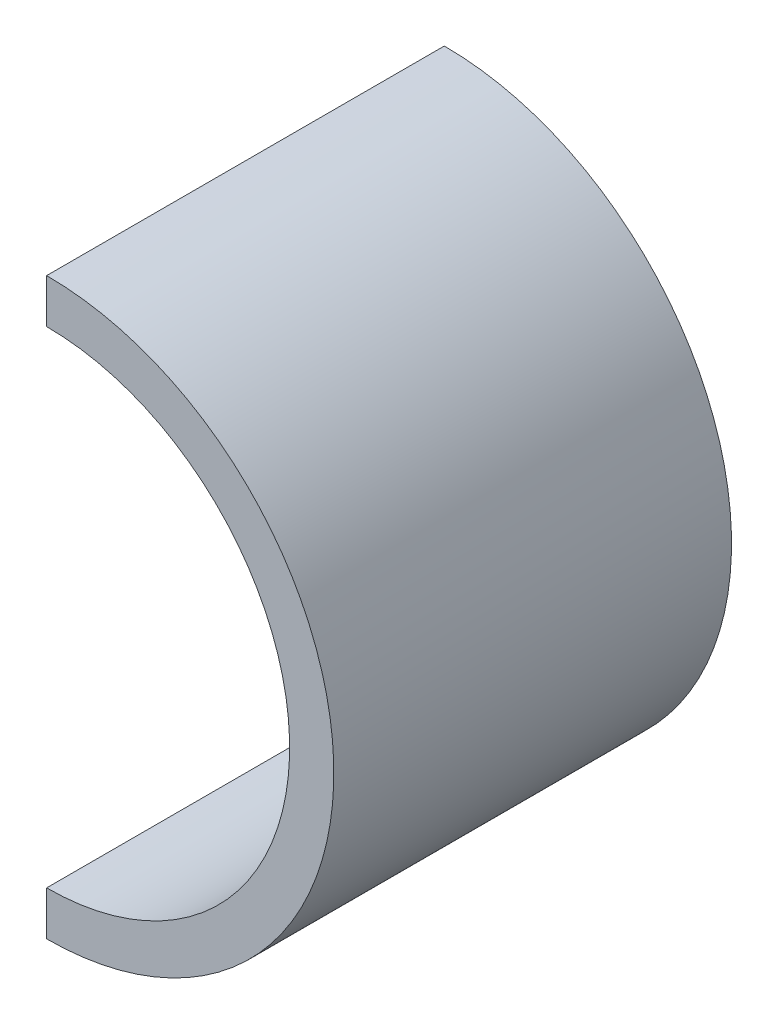
ISO-10303-21;
HEADER;
FILE_DESCRIPTION(('STEP AP214'),'2;1');
FILE_NAME('part.step','',(''),(''),'','','');
FILE_SCHEMA(('AUTOMOTIVE_DESIGN { 1 0 10303 214 1 1 1 1 }'));
ENDSEC;
DATA;
#1=APPLICATION_CONTEXT('core data for automotive mechanical design processes');
#2=APPLICATION_PROTOCOL_DEFINITION('international standard','automotive_design',2000,#1);
#3=PRODUCT_CONTEXT('',#1,'mechanical');
#4=PRODUCT('Part','Part','',(#3));
#5=PRODUCT_RELATED_PRODUCT_CATEGORY('part','',(#4));
#6=PRODUCT_DEFINITION_FORMATION('','',#4);
#7=PRODUCT_DEFINITION_CONTEXT('part definition',#1,'design');
#8=PRODUCT_DEFINITION('design','',#6,#7);
#9=PRODUCT_DEFINITION_SHAPE('','',#8);
#10=(LENGTH_UNIT() NAMED_UNIT(*) SI_UNIT(.MILLI.,.METRE.));
#11=(NAMED_UNIT(*) PLANE_ANGLE_UNIT() SI_UNIT($,.RADIAN.));
#12=(NAMED_UNIT(*) SI_UNIT($,.STERADIAN.) SOLID_ANGLE_UNIT());
#13=UNCERTAINTY_MEASURE_WITH_UNIT(LENGTH_MEASURE(1.E-05),#10,'distance_accuracy_value','');
#14=(GEOMETRIC_REPRESENTATION_CONTEXT(3) GLOBAL_UNCERTAINTY_ASSIGNED_CONTEXT((#13)) GLOBAL_UNIT_ASSIGNED_CONTEXT((#10,
#11,#12)) REPRESENTATION_CONTEXT('',''));
#15=CARTESIAN_POINT('',(0.,0.,0.));
#16=DIRECTION('',(0.,0.,1.));
#17=DIRECTION('',(1.,0.,0.));
#18=AXIS2_PLACEMENT_3D('',#15,#16,#17);
#19=CARTESIAN_POINT('',(0.,0.,180.));
#20=DIRECTION('',(0.,0.,-1.));
#21=DIRECTION('',(-1.,0.,0.));
#22=AXIS2_PLACEMENT_3D('',#19,#20,#21);
#23=CYLINDRICAL_SURFACE('',#22,130.);
#24=CARTESIAN_POINT('',(0.,0.,0.));
#25=DIRECTION('',(0.,0.,1.));
#26=DIRECTION('',(1.,0.,0.));
#27=AXIS2_PLACEMENT_3D('',#24,#25,#26);
#28=CIRCLE('',#27,130.);
#29=CARTESIAN_POINT('',(0.,-130.,0.));
#30=VERTEX_POINT('',#29);
#31=CARTESIAN_POINT('',(0.,130.,0.));
#32=VERTEX_POINT('',#31);
#33=EDGE_CURVE('E115',#30,#32,#28,.T.);
#34=ORIENTED_EDGE('',*,*,#33,.T.);
#35=DIRECTION('',(0.,0.,-1.));
#36=VECTOR('',#35,1.);
#37=CARTESIAN_POINT('',(0.,130.,180.));
#38=LINE('',#37,#36);
#39=CARTESIAN_POINT('',(0.,130.,180.));
#40=VERTEX_POINT('',#39);
#41=EDGE_CURVE('E11',#40,#32,#38,.T.);
#42=ORIENTED_EDGE('',*,*,#41,.F.);
#43=CARTESIAN_POINT('',(0.,0.,180.));
#44=DIRECTION('',(0.,0.,1.));
#45=DIRECTION('',(1.,0.,0.));
#46=AXIS2_PLACEMENT_3D('',#43,#44,#45);
#47=CIRCLE('',#46,130.);
#48=CARTESIAN_POINT('',(0.,-130.,180.));
#49=VERTEX_POINT('',#48);
#50=EDGE_CURVE('E88',#49,#40,#47,.T.);
#51=ORIENTED_EDGE('',*,*,#50,.F.);
#52=DIRECTION('',(0.,0.,-1.));
#53=VECTOR('',#52,1.);
#54=CARTESIAN_POINT('',(0.,-130.,180.));
#55=LINE('',#54,#53);
#56=EDGE_CURVE('E64',#49,#30,#55,.T.);
#57=ORIENTED_EDGE('',*,*,#56,.T.);
#58=EDGE_LOOP('',(#34,#42,#51,#57));
#59=FACE_BOUND('',#58,.T.);
#60=ADVANCED_FACE('F47',(#59),#23,.T.);
#61=CARTESIAN_POINT('',(0.,110.,180.));
#62=DIRECTION('',(-1.,0.,0.));
#63=DIRECTION('',(0.,-1.,0.));
#64=AXIS2_PLACEMENT_3D('',#61,#62,#63);
#65=PLANE('',#64);
#66=DIRECTION('',(0.,1.,0.));
#67=VECTOR('',#66,1.);
#68=CARTESIAN_POINT('',(0.,110.,0.));
#69=LINE('',#68,#67);
#70=CARTESIAN_POINT('',(0.,110.,0.));
#71=VERTEX_POINT('',#70);
#72=EDGE_CURVE('E97',#71,#32,#69,.T.);
#73=ORIENTED_EDGE('',*,*,#72,.F.);
#74=DIRECTION('',(0.,0.,-1.));
#75=VECTOR('',#74,1.);
#76=CARTESIAN_POINT('',(0.,110.,180.));
#77=LINE('',#76,#75);
#78=CARTESIAN_POINT('',(0.,110.,180.));
#79=VERTEX_POINT('',#78);
#80=EDGE_CURVE('E56',#79,#71,#77,.T.);
#81=ORIENTED_EDGE('',*,*,#80,.F.);
#82=DIRECTION('',(0.,1.,0.));
#83=VECTOR('',#82,1.);
#84=CARTESIAN_POINT('',(0.,110.,180.));
#85=LINE('',#84,#83);
#86=EDGE_CURVE('E95',#79,#40,#85,.T.);
#87=ORIENTED_EDGE('',*,*,#86,.T.);
#88=ORIENTED_EDGE('',*,*,#41,.T.);
#89=EDGE_LOOP('',(#73,#81,#87,#88));
#90=FACE_BOUND('',#89,.T.);
#91=ADVANCED_FACE('F94',(#90),#65,.T.);
#92=CARTESIAN_POINT('',(0.,0.,180.));
#93=DIRECTION('',(0.,0.,-1.));
#94=DIRECTION('',(-1.,0.,0.));
#95=AXIS2_PLACEMENT_3D('',#92,#93,#94);
#96=CYLINDRICAL_SURFACE('',#95,110.);
#97=CARTESIAN_POINT('',(0.,0.,0.));
#98=DIRECTION('',(0.,0.,1.));
#99=DIRECTION('',(1.,0.,0.));
#100=AXIS2_PLACEMENT_3D('',#97,#98,#99);
#101=CIRCLE('',#100,110.);
#102=CARTESIAN_POINT('',(0.,-110.,0.));
#103=VERTEX_POINT('',#102);
#104=EDGE_CURVE('E120',#103,#71,#101,.T.);
#105=ORIENTED_EDGE('',*,*,#104,.F.);
#106=DIRECTION('',(0.,0.,-1.));
#107=VECTOR('',#106,1.);
#108=CARTESIAN_POINT('',(0.,-110.,180.));
#109=LINE('',#108,#107);
#110=CARTESIAN_POINT('',(0.,-110.,180.));
#111=VERTEX_POINT('',#110);
#112=EDGE_CURVE('E77',#111,#103,#109,.T.);
#113=ORIENTED_EDGE('',*,*,#112,.F.);
#114=CARTESIAN_POINT('',(0.,0.,180.));
#115=DIRECTION('',(0.,0.,1.));
#116=DIRECTION('',(1.,0.,0.));
#117=AXIS2_PLACEMENT_3D('',#114,#115,#116);
#118=CIRCLE('',#117,110.);
#119=EDGE_CURVE('E104',#111,#79,#118,.T.);
#120=ORIENTED_EDGE('',*,*,#119,.T.);
#121=ORIENTED_EDGE('',*,*,#80,.T.);
#122=EDGE_LOOP('',(#105,#113,#120,#121));
#123=FACE_BOUND('',#122,.T.);
#124=ADVANCED_FACE('F107',(#123),#96,.F.);
#125=CARTESIAN_POINT('',(0.,-130.,180.));
#126=DIRECTION('',(-1.,0.,0.));
#127=DIRECTION('',(0.,-1.,0.));
#128=AXIS2_PLACEMENT_3D('',#125,#126,#127);
#129=PLANE('',#128);
#130=DIRECTION('',(0.,1.,0.));
#131=VECTOR('',#130,1.);
#132=CARTESIAN_POINT('',(0.,-130.,0.));
#133=LINE('',#132,#131);
#134=EDGE_CURVE('E123',#30,#103,#133,.T.);
#135=ORIENTED_EDGE('',*,*,#134,.F.);
#136=ORIENTED_EDGE('',*,*,#56,.F.);
#137=DIRECTION('',(0.,1.,0.));
#138=VECTOR('',#137,1.);
#139=CARTESIAN_POINT('',(0.,-130.,180.));
#140=LINE('',#139,#138);
#141=EDGE_CURVE('E109',#49,#111,#140,.T.);
#142=ORIENTED_EDGE('',*,*,#141,.T.);
#143=ORIENTED_EDGE('',*,*,#112,.T.);
#144=EDGE_LOOP('',(#135,#136,#142,#143));
#145=FACE_BOUND('',#144,.T.);
#146=ADVANCED_FACE('F133',(#145),#129,.T.);
#147=CARTESIAN_POINT('',(0.,0.,180.));
#148=DIRECTION('',(0.,0.,1.));
#149=DIRECTION('',(1.,0.,0.));
#150=AXIS2_PLACEMENT_3D('',#147,#148,#149);
#151=PLANE('',#150);
#152=ORIENTED_EDGE('',*,*,#50,.T.);
#153=ORIENTED_EDGE('',*,*,#86,.F.);
#154=ORIENTED_EDGE('',*,*,#119,.F.);
#155=ORIENTED_EDGE('',*,*,#141,.F.);
#156=EDGE_LOOP('',(#152,#153,#154,#155));
#157=FACE_BOUND('',#156,.T.);
#158=ADVANCED_FACE('F103',(#157),#151,.T.);
#159=CARTESIAN_POINT('',(0.,0.,0.));
#160=DIRECTION('',(0.,0.,1.));
#161=DIRECTION('',(1.,0.,0.));
#162=AXIS2_PLACEMENT_3D('',#159,#160,#161);
#163=PLANE('',#162);
#164=ORIENTED_EDGE('',*,*,#33,.F.);
#165=ORIENTED_EDGE('',*,*,#134,.T.);
#166=ORIENTED_EDGE('',*,*,#104,.T.);
#167=ORIENTED_EDGE('',*,*,#72,.T.);
#168=EDGE_LOOP('',(#164,#165,#166,#167));
#169=FACE_BOUND('',#168,.T.);
#170=ADVANCED_FACE('F132',(#169),#163,.F.);
#171=CLOSED_SHELL('',(#60,#91,#124,#146,#158,#170));
#172=MANIFOLD_SOLID_BREP('B2',#171);
#173=ADVANCED_BREP_SHAPE_REPRESENTATION('',(#18,#172),#14);
#174=SHAPE_DEFINITION_REPRESENTATION(#9,#173);
ENDSEC;
END-ISO-10303-21;
